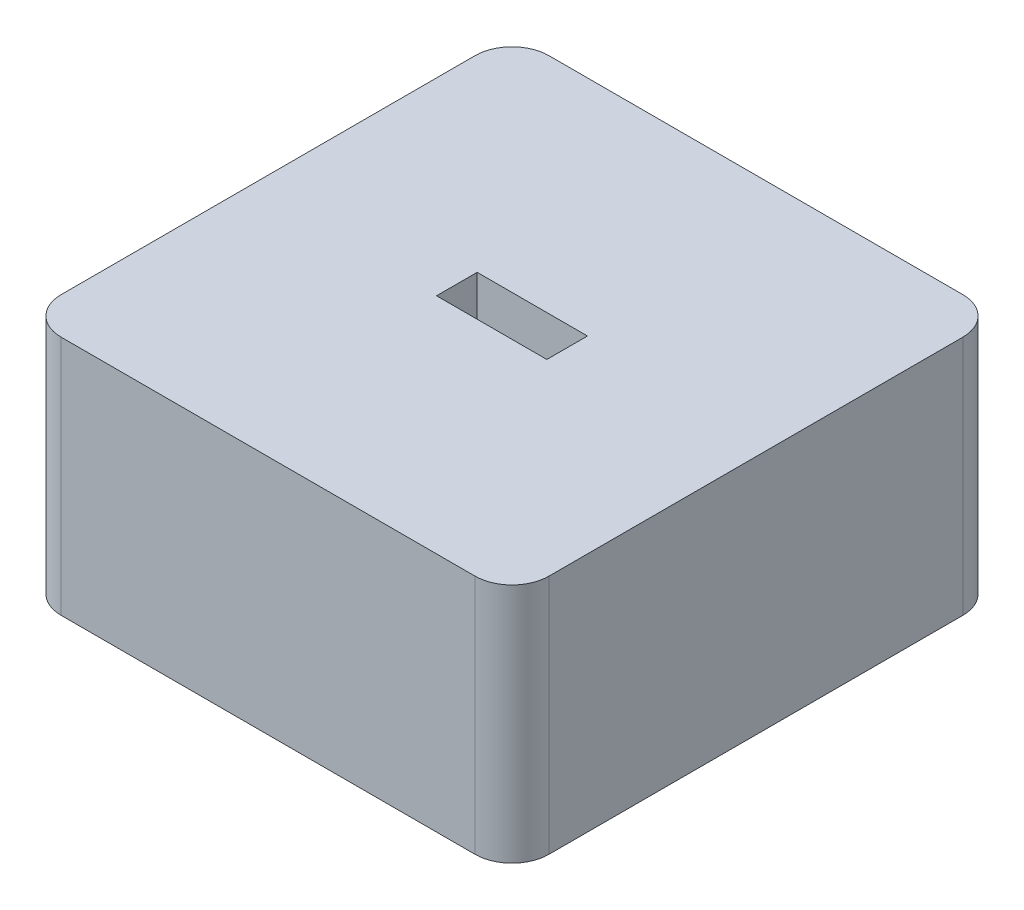
ISO-10303-21;
HEADER;
FILE_DESCRIPTION(('STEP AP214'),'2;1');
FILE_NAME('part.step','',(''),(''),'','','');
FILE_SCHEMA(('AUTOMOTIVE_DESIGN { 1 0 10303 214 1 1 1 1 }'));
ENDSEC;
DATA;
#1=APPLICATION_CONTEXT('core data for automotive mechanical design processes');
#2=APPLICATION_PROTOCOL_DEFINITION('international standard','automotive_design',2000,#1);
#3=PRODUCT_CONTEXT('',#1,'mechanical');
#4=PRODUCT('Part','Part','',(#3));
#5=PRODUCT_RELATED_PRODUCT_CATEGORY('part','',(#4));
#6=PRODUCT_DEFINITION_FORMATION('','',#4);
#7=PRODUCT_DEFINITION_CONTEXT('part definition',#1,'design');
#8=PRODUCT_DEFINITION('design','',#6,#7);
#9=PRODUCT_DEFINITION_SHAPE('','',#8);
#10=(LENGTH_UNIT() NAMED_UNIT(*) SI_UNIT(.MILLI.,.METRE.));
#11=(NAMED_UNIT(*) PLANE_ANGLE_UNIT() SI_UNIT($,.RADIAN.));
#12=(NAMED_UNIT(*) SI_UNIT($,.STERADIAN.) SOLID_ANGLE_UNIT());
#13=UNCERTAINTY_MEASURE_WITH_UNIT(LENGTH_MEASURE(1.E-05),#10,'distance_accuracy_value','');
#14=(GEOMETRIC_REPRESENTATION_CONTEXT(3) GLOBAL_UNCERTAINTY_ASSIGNED_CONTEXT((#13)) GLOBAL_UNIT_ASSIGNED_CONTEXT((#10,
#11,#12)) REPRESENTATION_CONTEXT('',''));
#15=CARTESIAN_POINT('',(0.,0.,0.));
#16=DIRECTION('',(0.,0.,1.));
#17=DIRECTION('',(1.,0.,0.));
#18=AXIS2_PLACEMENT_3D('',#15,#16,#17);
#19=CARTESIAN_POINT('',(0.,0.,0.));
#20=DIRECTION('',(0.,-1.,0.));
#21=DIRECTION('',(0.,0.,-1.));
#22=AXIS2_PLACEMENT_3D('',#19,#20,#21);
#23=PLANE('',#22);
#24=DIRECTION('',(0.,0.,-1.));
#25=VECTOR('',#24,1.);
#26=CARTESIAN_POINT('',(13.25,0.,-15.75));
#27=LINE('',#26,#25);
#28=CARTESIAN_POINT('',(13.25,0.,-15.75));
#29=VERTEX_POINT('',#28);
#30=CARTESIAN_POINT('',(13.25,0.,-26.25));
#31=VERTEX_POINT('',#30);
#32=EDGE_CURVE('E371',#29,#31,#27,.T.);
#33=ORIENTED_EDGE('',*,*,#32,.F.);
#34=DIRECTION('',(-1.,0.,0.));
#35=VECTOR('',#34,1.);
#36=CARTESIAN_POINT('',(13.25,0.,-15.75));
#37=LINE('',#36,#35);
#38=CARTESIAN_POINT('',(28.75,0.,-15.75));
#39=VERTEX_POINT('',#38);
#40=EDGE_CURVE('E377',#39,#29,#37,.T.);
#41=ORIENTED_EDGE('',*,*,#40,.F.);
#42=DIRECTION('',(0.,0.,1.));
#43=VECTOR('',#42,1.);
#44=CARTESIAN_POINT('',(28.75,0.,-15.75));
#45=LINE('',#44,#43);
#46=CARTESIAN_POINT('',(28.75,0.,-26.25));
#47=VERTEX_POINT('',#46);
#48=EDGE_CURVE('E396',#47,#39,#45,.T.);
#49=ORIENTED_EDGE('',*,*,#48,.F.);
#50=DIRECTION('',(1.,0.,0.));
#51=VECTOR('',#50,1.);
#52=CARTESIAN_POINT('',(13.25,0.,-26.25));
#53=LINE('',#52,#51);
#54=EDGE_CURVE('E392',#31,#47,#53,.T.);
#55=ORIENTED_EDGE('',*,*,#54,.F.);
#56=EDGE_LOOP('',(#33,#41,#49,#55));
#57=FACE_BOUND('',#56,.T.);
#58=DIRECTION('',(1.,0.,0.));
#59=VECTOR('',#58,1.);
#60=CARTESIAN_POINT('',(10.25,0.,-29.25));
#61=LINE('',#60,#59);
#62=CARTESIAN_POINT('',(10.25,0.,-29.25));
#63=VERTEX_POINT('',#62);
#64=CARTESIAN_POINT('',(31.75,0.,-29.25));
#65=VERTEX_POINT('',#64);
#66=EDGE_CURVE('E256',#63,#65,#61,.T.);
#67=ORIENTED_EDGE('',*,*,#66,.T.);
#68=DIRECTION('',(0.,0.,1.));
#69=VECTOR('',#68,1.);
#70=CARTESIAN_POINT('',(31.75,0.,-29.25));
#71=LINE('',#70,#69);
#72=CARTESIAN_POINT('',(31.75,0.,-12.75));
#73=VERTEX_POINT('',#72);
#74=EDGE_CURVE('E268',#65,#73,#71,.T.);
#75=ORIENTED_EDGE('',*,*,#74,.T.);
#76=DIRECTION('',(-1.,0.,0.));
#77=VECTOR('',#76,1.);
#78=CARTESIAN_POINT('',(31.75,0.,-12.75));
#79=LINE('',#78,#77);
#80=CARTESIAN_POINT('',(10.25,0.,-12.75));
#81=VERTEX_POINT('',#80);
#82=EDGE_CURVE('E232',#73,#81,#79,.T.);
#83=ORIENTED_EDGE('',*,*,#82,.T.);
#84=DIRECTION('',(0.,0.,-1.));
#85=VECTOR('',#84,1.);
#86=CARTESIAN_POINT('',(10.25,0.,-12.75));
#87=LINE('',#86,#85);
#88=EDGE_CURVE('E261',#81,#63,#87,.T.);
#89=ORIENTED_EDGE('',*,*,#88,.T.);
#90=EDGE_LOOP('',(#67,#75,#83,#89));
#91=FACE_BOUND('',#90,.T.);
#92=ADVANCED_FACE('F39',(#57,#91),#23,.T.);
#93=CARTESIAN_POINT('',(0.,17.23,0.));
#94=DIRECTION('',(0.,-1.,0.));
#95=DIRECTION('',(0.,0.,-1.));
#96=AXIS2_PLACEMENT_3D('',#93,#94,#95);
#97=PLANE('',#96);
#98=DIRECTION('',(1.,0.,0.));
#99=VECTOR('',#98,1.);
#100=CARTESIAN_POINT('',(16.25,17.23,-22.75));
#101=LINE('',#100,#99);
#102=CARTESIAN_POINT('',(16.25,17.23,-22.75));
#103=VERTEX_POINT('',#102);
#104=CARTESIAN_POINT('',(25.75,17.23,-22.75));
#105=VERTEX_POINT('',#104);
#106=EDGE_CURVE('E416',#103,#105,#101,.T.);
#107=ORIENTED_EDGE('',*,*,#106,.F.);
#108=DIRECTION('',(0.,0.,1.));
#109=VECTOR('',#108,1.);
#110=CARTESIAN_POINT('',(16.25,17.23,-22.75));
#111=LINE('',#110,#109);
#112=CARTESIAN_POINT('',(16.25,17.23,-19.25));
#113=VERTEX_POINT('',#112);
#114=EDGE_CURVE('E428',#103,#113,#111,.T.);
#115=ORIENTED_EDGE('',*,*,#114,.T.);
#116=DIRECTION('',(1.,0.,0.));
#117=VECTOR('',#116,1.);
#118=CARTESIAN_POINT('',(16.25,17.23,-19.25));
#119=LINE('',#118,#117);
#120=CARTESIAN_POINT('',(25.75,17.23,-19.25));
#121=VERTEX_POINT('',#120);
#122=EDGE_CURVE('E424',#113,#121,#119,.T.);
#123=ORIENTED_EDGE('',*,*,#122,.T.);
#124=DIRECTION('',(0.,0.,1.));
#125=VECTOR('',#124,1.);
#126=CARTESIAN_POINT('',(25.75,17.23,-22.75));
#127=LINE('',#126,#125);
#128=EDGE_CURVE('E420',#105,#121,#127,.T.);
#129=ORIENTED_EDGE('',*,*,#128,.F.);
#130=EDGE_LOOP('',(#107,#115,#123,#129));
#131=FACE_BOUND('',#130,.T.);
#132=CARTESIAN_POINT('',(17.975,17.23,-21.));
#133=DIRECTION('',(0.,1.,0.));
#134=DIRECTION('',(0.,0.,1.));
#135=AXIS2_PLACEMENT_3D('',#132,#133,#134);
#136=CIRCLE('',#135,1.275);
#137=CARTESIAN_POINT('',(17.975,17.23,-22.275));
#138=VERTEX_POINT('',#137);
#139=CARTESIAN_POINT('',(17.975,17.23,-19.725));
#140=VERTEX_POINT('',#139);
#141=EDGE_CURVE('E339',#138,#140,#136,.T.);
#142=ORIENTED_EDGE('',*,*,#141,.F.);
#143=DIRECTION('',(-1.,0.,0.));
#144=VECTOR('',#143,1.);
#145=CARTESIAN_POINT('',(17.975,17.23,-22.275));
#146=LINE('',#145,#144);
#147=CARTESIAN_POINT('',(24.025,17.23,-22.275));
#148=VERTEX_POINT('',#147);
#149=EDGE_CURVE('E350',#148,#138,#146,.T.);
#150=ORIENTED_EDGE('',*,*,#149,.F.);
#151=CARTESIAN_POINT('',(24.025,17.23,-21.));
#152=DIRECTION('',(0.,1.,0.));
#153=DIRECTION('',(0.,0.,1.));
#154=AXIS2_PLACEMENT_3D('',#151,#152,#153);
#155=CIRCLE('',#154,1.275);
#156=CARTESIAN_POINT('',(24.025,17.23,-19.725));
#157=VERTEX_POINT('',#156);
#158=EDGE_CURVE('E347',#157,#148,#155,.T.);
#159=ORIENTED_EDGE('',*,*,#158,.F.);
#160=DIRECTION('',(1.,0.,0.));
#161=VECTOR('',#160,1.);
#162=CARTESIAN_POINT('',(17.975,17.23,-19.725));
#163=LINE('',#162,#161);
#164=EDGE_CURVE('E343',#140,#157,#163,.T.);
#165=ORIENTED_EDGE('',*,*,#164,.F.);
#166=EDGE_LOOP('',(#142,#150,#159,#165));
#167=FACE_BOUND('',#166,.T.);
#168=ADVANCED_FACE('F574',(#131,#167),#97,.F.);
#169=CARTESIAN_POINT('',(0.,15.23,0.));
#170=DIRECTION('',(0.,-1.,0.));
#171=DIRECTION('',(0.,0.,-1.));
#172=AXIS2_PLACEMENT_3D('',#169,#170,#171);
#173=PLANE('',#172);
#174=DIRECTION('',(0.,0.,-1.));
#175=VECTOR('',#174,1.);
#176=CARTESIAN_POINT('',(13.25,15.23,-15.75));
#177=LINE('',#176,#175);
#178=CARTESIAN_POINT('',(13.25,15.23,-15.75));
#179=VERTEX_POINT('',#178);
#180=CARTESIAN_POINT('',(13.25,15.23,-26.25));
#181=VERTEX_POINT('',#180);
#182=EDGE_CURVE('E372',#179,#181,#177,.T.);
#183=ORIENTED_EDGE('',*,*,#182,.T.);
#184=DIRECTION('',(1.,0.,0.));
#185=VECTOR('',#184,1.);
#186=CARTESIAN_POINT('',(13.25,15.23,-26.25));
#187=LINE('',#186,#185);
#188=CARTESIAN_POINT('',(28.75,15.23,-26.25));
#189=VERTEX_POINT('',#188);
#190=EDGE_CURVE('E376',#181,#189,#187,.T.);
#191=ORIENTED_EDGE('',*,*,#190,.T.);
#192=DIRECTION('',(0.,0.,1.));
#193=VECTOR('',#192,1.);
#194=CARTESIAN_POINT('',(28.75,15.23,-15.75));
#195=LINE('',#194,#193);
#196=CARTESIAN_POINT('',(28.75,15.23,-15.75));
#197=VERTEX_POINT('',#196);
#198=EDGE_CURVE('E381',#189,#197,#195,.T.);
#199=ORIENTED_EDGE('',*,*,#198,.T.);
#200=DIRECTION('',(-1.,0.,0.));
#201=VECTOR('',#200,1.);
#202=CARTESIAN_POINT('',(13.25,15.23,-15.75));
#203=LINE('',#202,#201);
#204=EDGE_CURVE('E385',#197,#179,#203,.T.);
#205=ORIENTED_EDGE('',*,*,#204,.T.);
#206=EDGE_LOOP('',(#183,#191,#199,#205));
#207=FACE_BOUND('',#206,.T.);
#208=DIRECTION('',(-1.,0.,0.));
#209=VECTOR('',#208,1.);
#210=CARTESIAN_POINT('',(17.975,15.23,-22.275));
#211=LINE('',#210,#209);
#212=CARTESIAN_POINT('',(24.025,15.23,-22.275));
#213=VERTEX_POINT('',#212);
#214=CARTESIAN_POINT('',(17.975,15.23,-22.275));
#215=VERTEX_POINT('',#214);
#216=EDGE_CURVE('E331',#213,#215,#211,.T.);
#217=ORIENTED_EDGE('',*,*,#216,.T.);
#218=CARTESIAN_POINT('',(17.975,15.23,-21.));
#219=DIRECTION('',(0.,-1.,0.));
#220=DIRECTION('',(0.,0.,-1.));
#221=AXIS2_PLACEMENT_3D('',#218,#219,#220);
#222=CIRCLE('',#221,1.275);
#223=CARTESIAN_POINT('',(17.975,15.23,-19.725));
#224=VERTEX_POINT('',#223);
#225=EDGE_CURVE('E335',#215,#224,#222,.F.);
#226=ORIENTED_EDGE('',*,*,#225,.T.);
#227=DIRECTION('',(1.,0.,0.));
#228=VECTOR('',#227,1.);
#229=CARTESIAN_POINT('',(17.975,15.23,-19.725));
#230=LINE('',#229,#228);
#231=CARTESIAN_POINT('',(24.025,15.23,-19.725));
#232=VERTEX_POINT('',#231);
#233=EDGE_CURVE('E358',#224,#232,#230,.T.);
#234=ORIENTED_EDGE('',*,*,#233,.T.);
#235=CARTESIAN_POINT('',(24.025,15.23,-21.));
#236=DIRECTION('',(0.,-1.,0.));
#237=DIRECTION('',(0.,0.,-1.));
#238=AXIS2_PLACEMENT_3D('',#235,#236,#237);
#239=CIRCLE('',#238,1.275);
#240=EDGE_CURVE('E318',#232,#213,#239,.F.);
#241=ORIENTED_EDGE('',*,*,#240,.T.);
#242=EDGE_LOOP('',(#217,#226,#234,#241));
#243=FACE_BOUND('',#242,.T.);
#244=ADVANCED_FACE('F580',(#207,#243),#173,.T.);
#245=CARTESIAN_POINT('',(0.,20.75,0.));
#246=DIRECTION('',(0.,-1.,0.));
#247=DIRECTION('',(0.,0.,-1.));
#248=AXIS2_PLACEMENT_3D('',#245,#246,#247);
#249=PLANE('',#248);
#250=DIRECTION('',(0.,0.,-1.));
#251=VECTOR('',#250,1.);
#252=CARTESIAN_POINT('',(42.,20.75,0.));
#253=LINE('',#252,#251);
#254=CARTESIAN_POINT('',(42.,20.75,-3.175));
#255=VERTEX_POINT('',#254);
#256=CARTESIAN_POINT('',(42.,20.75,-38.825));
#257=VERTEX_POINT('',#256);
#258=EDGE_CURVE('E468',#255,#257,#253,.T.);
#259=ORIENTED_EDGE('',*,*,#258,.T.);
#260=CARTESIAN_POINT('',(38.825,20.75,-38.825));
#261=DIRECTION('',(0.,-1.,0.));
#262=DIRECTION('',(0.,0.,-1.));
#263=AXIS2_PLACEMENT_3D('',#260,#261,#262);
#264=CIRCLE('',#263,3.175);
#265=CARTESIAN_POINT('',(38.825,20.75,-42.));
#266=VERTEX_POINT('',#265);
#267=EDGE_CURVE('E523',#257,#266,#264,.F.);
#268=ORIENTED_EDGE('',*,*,#267,.T.);
#269=DIRECTION('',(-1.,0.,0.));
#270=VECTOR('',#269,1.);
#271=CARTESIAN_POINT('',(0.,20.75,-42.));
#272=LINE('',#271,#270);
#273=CARTESIAN_POINT('',(3.175,20.75,-42.));
#274=VERTEX_POINT('',#273);
#275=EDGE_CURVE('E472',#266,#274,#272,.T.);
#276=ORIENTED_EDGE('',*,*,#275,.T.);
#277=CARTESIAN_POINT('',(3.175,20.75,-38.825));
#278=DIRECTION('',(0.,-1.,0.));
#279=DIRECTION('',(0.,0.,-1.));
#280=AXIS2_PLACEMENT_3D('',#277,#278,#279);
#281=CIRCLE('',#280,3.175);
#282=CARTESIAN_POINT('',(0.,20.75,-38.825));
#283=VERTEX_POINT('',#282);
#284=EDGE_CURVE('E515',#274,#283,#281,.F.);
#285=ORIENTED_EDGE('',*,*,#284,.T.);
#286=DIRECTION('',(0.,0.,1.));
#287=VECTOR('',#286,1.);
#288=CARTESIAN_POINT('',(0.,20.75,0.));
#289=LINE('',#288,#287);
#290=CARTESIAN_POINT('',(0.,20.75,-3.175));
#291=VERTEX_POINT('',#290);
#292=EDGE_CURVE('E461',#283,#291,#289,.T.);
#293=ORIENTED_EDGE('',*,*,#292,.T.);
#294=CARTESIAN_POINT('',(3.175,20.75,-3.175));
#295=DIRECTION('',(0.,-1.,0.));
#296=DIRECTION('',(0.,0.,-1.));
#297=AXIS2_PLACEMENT_3D('',#294,#295,#296);
#298=CIRCLE('',#297,3.175);
#299=CARTESIAN_POINT('',(3.175,20.75,0.));
#300=VERTEX_POINT('',#299);
#301=EDGE_CURVE('E62',#291,#300,#298,.F.);
#302=ORIENTED_EDGE('',*,*,#301,.T.);
#303=DIRECTION('',(1.,0.,0.));
#304=VECTOR('',#303,1.);
#305=CARTESIAN_POINT('',(0.,20.75,0.));
#306=LINE('',#305,#304);
#307=CARTESIAN_POINT('',(38.825,20.75,0.));
#308=VERTEX_POINT('',#307);
#309=EDGE_CURVE('E464',#300,#308,#306,.T.);
#310=ORIENTED_EDGE('',*,*,#309,.T.);
#311=CARTESIAN_POINT('',(38.825,20.75,-3.175));
#312=DIRECTION('',(0.,-1.,0.));
#313=DIRECTION('',(0.,0.,-1.));
#314=AXIS2_PLACEMENT_3D('',#311,#312,#313);
#315=CIRCLE('',#314,3.175);
#316=EDGE_CURVE('E520',#308,#255,#315,.F.);
#317=ORIENTED_EDGE('',*,*,#316,.T.);
#318=EDGE_LOOP('',(#259,#268,#276,#285,#293,#302,#310,#317));
#319=FACE_BOUND('',#318,.T.);
#320=DIRECTION('',(1.,0.,0.));
#321=VECTOR('',#320,1.);
#322=CARTESIAN_POINT('',(16.25,20.75,-22.75));
#323=LINE('',#322,#321);
#324=CARTESIAN_POINT('',(16.25,20.75,-22.75));
#325=VERTEX_POINT('',#324);
#326=CARTESIAN_POINT('',(25.75,20.75,-22.75));
#327=VERTEX_POINT('',#326);
#328=EDGE_CURVE('E406',#325,#327,#323,.T.);
#329=ORIENTED_EDGE('',*,*,#328,.T.);
#330=DIRECTION('',(0.,0.,1.));
#331=VECTOR('',#330,1.);
#332=CARTESIAN_POINT('',(25.75,20.75,-22.75));
#333=LINE('',#332,#331);
#334=CARTESIAN_POINT('',(25.75,20.75,-19.25));
#335=VERTEX_POINT('',#334);
#336=EDGE_CURVE('E436',#327,#335,#333,.T.);
#337=ORIENTED_EDGE('',*,*,#336,.T.);
#338=DIRECTION('',(1.,0.,0.));
#339=VECTOR('',#338,1.);
#340=CARTESIAN_POINT('',(16.25,20.75,-19.25));
#341=LINE('',#340,#339);
#342=CARTESIAN_POINT('',(16.25,20.75,-19.25));
#343=VERTEX_POINT('',#342);
#344=EDGE_CURVE('E440',#343,#335,#341,.T.);
#345=ORIENTED_EDGE('',*,*,#344,.F.);
#346=DIRECTION('',(0.,0.,1.));
#347=VECTOR('',#346,1.);
#348=CARTESIAN_POINT('',(16.25,20.75,-22.75));
#349=LINE('',#348,#347);
#350=EDGE_CURVE('E421',#325,#343,#349,.T.);
#351=ORIENTED_EDGE('',*,*,#350,.F.);
#352=EDGE_LOOP('',(#329,#337,#345,#351));
#353=FACE_BOUND('',#352,.T.);
#354=ADVANCED_FACE('F551',(#319,#353),#249,.F.);
#355=CARTESIAN_POINT('',(0.,20.75,0.));
#356=DIRECTION('',(1.,0.,0.));
#357=DIRECTION('',(0.,0.,-1.));
#358=AXIS2_PLACEMENT_3D('',#355,#356,#357);
#359=PLANE('',#358);
#360=DIRECTION('',(0.,0.,1.));
#361=VECTOR('',#360,1.);
#362=CARTESIAN_POINT('',(0.,0.,0.));
#363=LINE('',#362,#361);
#364=CARTESIAN_POINT('',(0.,0.,-38.825));
#365=VERTEX_POINT('',#364);
#366=CARTESIAN_POINT('',(0.,0.,-3.175));
#367=VERTEX_POINT('',#366);
#368=EDGE_CURVE('E460',#365,#367,#363,.T.);
#369=ORIENTED_EDGE('',*,*,#368,.T.);
#370=DIRECTION('',(0.,-1.,0.));
#371=VECTOR('',#370,1.);
#372=CARTESIAN_POINT('',(0.,20.75,-3.175));
#373=LINE('',#372,#371);
#374=EDGE_CURVE('E11',#367,#291,#373,.F.);
#375=ORIENTED_EDGE('',*,*,#374,.T.);
#376=ORIENTED_EDGE('',*,*,#292,.F.);
#377=DIRECTION('',(0.,-1.,0.));
#378=VECTOR('',#377,1.);
#379=CARTESIAN_POINT('',(0.,20.75,-38.825));
#380=LINE('',#379,#378);
#381=EDGE_CURVE('E48',#283,#365,#380,.T.);
#382=ORIENTED_EDGE('',*,*,#381,.T.);
#383=EDGE_LOOP('',(#369,#375,#376,#382));
#384=FACE_BOUND('',#383,.T.);
#385=ADVANCED_FACE('F538',(#384),#359,.F.);
#386=CARTESIAN_POINT('',(0.,20.75,0.));
#387=DIRECTION('',(0.,0.,-1.));
#388=DIRECTION('',(-1.,0.,0.));
#389=AXIS2_PLACEMENT_3D('',#386,#387,#388);
#390=PLANE('',#389);
#391=DIRECTION('',(1.,0.,0.));
#392=VECTOR('',#391,1.);
#393=CARTESIAN_POINT('',(0.,0.,0.));
#394=LINE('',#393,#392);
#395=CARTESIAN_POINT('',(3.175,0.,0.));
#396=VERTEX_POINT('',#395);
#397=CARTESIAN_POINT('',(38.825,0.,0.));
#398=VERTEX_POINT('',#397);
#399=EDGE_CURVE('E480',#396,#398,#394,.T.);
#400=ORIENTED_EDGE('',*,*,#399,.T.);
#401=DIRECTION('',(0.,-1.,0.));
#402=VECTOR('',#401,1.);
#403=CARTESIAN_POINT('',(38.825,20.75,0.));
#404=LINE('',#403,#402);
#405=EDGE_CURVE('E55',#398,#308,#404,.F.);
#406=ORIENTED_EDGE('',*,*,#405,.T.);
#407=ORIENTED_EDGE('',*,*,#309,.F.);
#408=DIRECTION('',(0.,-1.,0.));
#409=VECTOR('',#408,1.);
#410=CARTESIAN_POINT('',(3.175,20.75,0.));
#411=LINE('',#410,#409);
#412=EDGE_CURVE('E526',#300,#396,#411,.T.);
#413=ORIENTED_EDGE('',*,*,#412,.T.);
#414=EDGE_LOOP('',(#400,#406,#407,#413));
#415=FACE_BOUND('',#414,.T.);
#416=ADVANCED_FACE('F549',(#415),#390,.F.);
#417=CARTESIAN_POINT('',(42.,20.75,0.));
#418=DIRECTION('',(-1.,0.,0.));
#419=DIRECTION('',(0.,0.,1.));
#420=AXIS2_PLACEMENT_3D('',#417,#418,#419);
#421=PLANE('',#420);
#422=DIRECTION('',(0.,0.,-1.));
#423=VECTOR('',#422,1.);
#424=CARTESIAN_POINT('',(42.,0.,0.));
#425=LINE('',#424,#423);
#426=CARTESIAN_POINT('',(42.,0.,-3.175));
#427=VERTEX_POINT('',#426);
#428=CARTESIAN_POINT('',(42.,0.,-38.825));
#429=VERTEX_POINT('',#428);
#430=EDGE_CURVE('E483',#427,#429,#425,.T.);
#431=ORIENTED_EDGE('',*,*,#430,.T.);
#432=DIRECTION('',(0.,-1.,0.));
#433=VECTOR('',#432,1.);
#434=CARTESIAN_POINT('',(42.,20.75,-38.825));
#435=LINE('',#434,#433);
#436=EDGE_CURVE('E512',#429,#257,#435,.F.);
#437=ORIENTED_EDGE('',*,*,#436,.T.);
#438=ORIENTED_EDGE('',*,*,#258,.F.);
#439=DIRECTION('',(0.,-1.,0.));
#440=VECTOR('',#439,1.);
#441=CARTESIAN_POINT('',(42.,20.75,-3.175));
#442=LINE('',#441,#440);
#443=EDGE_CURVE('E508',#255,#427,#442,.T.);
#444=ORIENTED_EDGE('',*,*,#443,.T.);
#445=EDGE_LOOP('',(#431,#437,#438,#444));
#446=FACE_BOUND('',#445,.T.);
#447=ADVANCED_FACE('F559',(#446),#421,.F.);
#448=CARTESIAN_POINT('',(0.,20.75,-42.));
#449=DIRECTION('',(0.,0.,1.));
#450=DIRECTION('',(1.,0.,0.));
#451=AXIS2_PLACEMENT_3D('',#448,#449,#450);
#452=PLANE('',#451);
#453=ORIENTED_EDGE('',*,*,#275,.F.);
#454=DIRECTION('',(0.,-1.,0.));
#455=VECTOR('',#454,1.);
#456=CARTESIAN_POINT('',(38.825,20.75,-42.));
#457=LINE('',#456,#455);
#458=CARTESIAN_POINT('',(38.825,0.,-42.));
#459=VERTEX_POINT('',#458);
#460=EDGE_CURVE('E492',#266,#459,#457,.T.);
#461=ORIENTED_EDGE('',*,*,#460,.T.);
#462=DIRECTION('',(-1.,0.,0.));
#463=VECTOR('',#462,1.);
#464=CARTESIAN_POINT('',(0.,0.,-42.));
#465=LINE('',#464,#463);
#466=CARTESIAN_POINT('',(3.175,0.,-42.));
#467=VERTEX_POINT('',#466);
#468=EDGE_CURVE('E465',#459,#467,#465,.T.);
#469=ORIENTED_EDGE('',*,*,#468,.T.);
#470=DIRECTION('',(0.,-1.,0.));
#471=VECTOR('',#470,1.);
#472=CARTESIAN_POINT('',(3.175,20.75,-42.));
#473=LINE('',#472,#471);
#474=EDGE_CURVE('E476',#467,#274,#473,.F.);
#475=ORIENTED_EDGE('',*,*,#474,.T.);
#476=EDGE_LOOP('',(#453,#461,#469,#475));
#477=FACE_BOUND('',#476,.T.);
#478=ADVANCED_FACE('F567',(#477),#452,.F.);
#479=DIRECTION('',(0.,0.,-1.));
#480=VECTOR('',#479,1.);
#481=CARTESIAN_POINT('',(4.,0.,-4.));
#482=LINE('',#481,#480);
#483=CARTESIAN_POINT('',(4.,0.,-4.));
#484=VERTEX_POINT('',#483);
#485=CARTESIAN_POINT('',(4.,0.,-38.));
#486=VERTEX_POINT('',#485);
#487=EDGE_CURVE('E278',#484,#486,#482,.T.);
#488=ORIENTED_EDGE('',*,*,#487,.F.);
#489=DIRECTION('',(-1.,0.,0.));
#490=VECTOR('',#489,1.);
#491=CARTESIAN_POINT('',(4.,0.,-4.));
#492=LINE('',#491,#490);
#493=CARTESIAN_POINT('',(38.,0.,-4.));
#494=VERTEX_POINT('',#493);
#495=EDGE_CURVE('E289',#494,#484,#492,.T.);
#496=ORIENTED_EDGE('',*,*,#495,.F.);
#497=DIRECTION('',(0.,0.,1.));
#498=VECTOR('',#497,1.);
#499=CARTESIAN_POINT('',(38.,0.,-4.));
#500=LINE('',#499,#498);
#501=CARTESIAN_POINT('',(38.,0.,-38.));
#502=VERTEX_POINT('',#501);
#503=EDGE_CURVE('E308',#502,#494,#500,.T.);
#504=ORIENTED_EDGE('',*,*,#503,.F.);
#505=DIRECTION('',(1.,0.,0.));
#506=VECTOR('',#505,1.);
#507=CARTESIAN_POINT('',(4.,0.,-38.));
#508=LINE('',#507,#506);
#509=EDGE_CURVE('E304',#486,#502,#508,.T.);
#510=ORIENTED_EDGE('',*,*,#509,.F.);
#511=EDGE_LOOP('',(#488,#496,#504,#510));
#512=FACE_BOUND('',#511,.T.);
#513=ORIENTED_EDGE('',*,*,#468,.F.);
#514=CARTESIAN_POINT('',(38.825,0.,-38.825));
#515=DIRECTION('',(0.,-1.,0.));
#516=DIRECTION('',(0.,0.,-1.));
#517=AXIS2_PLACEMENT_3D('',#514,#515,#516);
#518=CIRCLE('',#517,3.175);
#519=EDGE_CURVE('E505',#459,#429,#518,.T.);
#520=ORIENTED_EDGE('',*,*,#519,.T.);
#521=ORIENTED_EDGE('',*,*,#430,.F.);
#522=CARTESIAN_POINT('',(38.825,0.,-3.175));
#523=DIRECTION('',(0.,-1.,0.));
#524=DIRECTION('',(0.,0.,-1.));
#525=AXIS2_PLACEMENT_3D('',#522,#523,#524);
#526=CIRCLE('',#525,3.175);
#527=EDGE_CURVE('E502',#427,#398,#526,.T.);
#528=ORIENTED_EDGE('',*,*,#527,.T.);
#529=ORIENTED_EDGE('',*,*,#399,.F.);
#530=CARTESIAN_POINT('',(3.175,0.,-3.175));
#531=DIRECTION('',(0.,-1.,0.));
#532=DIRECTION('',(0.,0.,-1.));
#533=AXIS2_PLACEMENT_3D('',#530,#531,#532);
#534=CIRCLE('',#533,3.175);
#535=EDGE_CURVE('E499',#396,#367,#534,.T.);
#536=ORIENTED_EDGE('',*,*,#535,.T.);
#537=ORIENTED_EDGE('',*,*,#368,.F.);
#538=CARTESIAN_POINT('',(3.175,0.,-38.825));
#539=DIRECTION('',(0.,-1.,0.));
#540=DIRECTION('',(0.,0.,-1.));
#541=AXIS2_PLACEMENT_3D('',#538,#539,#540);
#542=CIRCLE('',#541,3.175);
#543=EDGE_CURVE('E496',#365,#467,#542,.T.);
#544=ORIENTED_EDGE('',*,*,#543,.T.);
#545=EDGE_LOOP('',(#513,#520,#521,#528,#529,#536,#537,#544));
#546=FACE_BOUND('',#545,.T.);
#547=ADVANCED_FACE('F544',(#512,#546),#23,.T.);
#548=CARTESIAN_POINT('',(16.25,17.23,-22.75));
#549=DIRECTION('',(0.,0.,1.));
#550=DIRECTION('',(1.,0.,0.));
#551=AXIS2_PLACEMENT_3D('',#548,#549,#550);
#552=PLANE('',#551);
#553=ORIENTED_EDGE('',*,*,#328,.F.);
#554=DIRECTION('',(0.,1.,0.));
#555=VECTOR('',#554,1.);
#556=CARTESIAN_POINT('',(16.25,17.23,-22.75));
#557=LINE('',#556,#555);
#558=EDGE_CURVE('E432',#103,#325,#557,.T.);
#559=ORIENTED_EDGE('',*,*,#558,.F.);
#560=ORIENTED_EDGE('',*,*,#106,.T.);
#561=DIRECTION('',(0.,1.,0.));
#562=VECTOR('',#561,1.);
#563=CARTESIAN_POINT('',(25.75,17.23,-22.75));
#564=LINE('',#563,#562);
#565=EDGE_CURVE('E456',#105,#327,#564,.T.);
#566=ORIENTED_EDGE('',*,*,#565,.T.);
#567=EDGE_LOOP('',(#553,#559,#560,#566));
#568=FACE_BOUND('',#567,.T.);
#569=ADVANCED_FACE('F588',(#568),#552,.T.);
#570=CARTESIAN_POINT('',(25.75,17.23,-22.75));
#571=DIRECTION('',(-1.,0.,0.));
#572=DIRECTION('',(0.,0.,1.));
#573=AXIS2_PLACEMENT_3D('',#570,#571,#572);
#574=PLANE('',#573);
#575=ORIENTED_EDGE('',*,*,#336,.F.);
#576=ORIENTED_EDGE('',*,*,#565,.F.);
#577=ORIENTED_EDGE('',*,*,#128,.T.);
#578=DIRECTION('',(0.,1.,0.));
#579=VECTOR('',#578,1.);
#580=CARTESIAN_POINT('',(25.75,17.23,-19.25));
#581=LINE('',#580,#579);
#582=EDGE_CURVE('E453',#121,#335,#581,.T.);
#583=ORIENTED_EDGE('',*,*,#582,.T.);
#584=EDGE_LOOP('',(#575,#576,#577,#583));
#585=FACE_BOUND('',#584,.T.);
#586=ADVANCED_FACE('F594',(#585),#574,.T.);
#587=CARTESIAN_POINT('',(16.25,17.23,-19.25));
#588=DIRECTION('',(0.,0.,1.));
#589=DIRECTION('',(1.,0.,0.));
#590=AXIS2_PLACEMENT_3D('',#587,#588,#589);
#591=PLANE('',#590);
#592=ORIENTED_EDGE('',*,*,#344,.T.);
#593=ORIENTED_EDGE('',*,*,#582,.F.);
#594=ORIENTED_EDGE('',*,*,#122,.F.);
#595=DIRECTION('',(0.,1.,0.));
#596=VECTOR('',#595,1.);
#597=CARTESIAN_POINT('',(16.25,17.23,-19.25));
#598=LINE('',#597,#596);
#599=EDGE_CURVE('E450',#113,#343,#598,.T.);
#600=ORIENTED_EDGE('',*,*,#599,.T.);
#601=EDGE_LOOP('',(#592,#593,#594,#600));
#602=FACE_BOUND('',#601,.T.);
#603=ADVANCED_FACE('F663',(#602),#591,.F.);
#604=CARTESIAN_POINT('',(16.25,17.23,-22.75));
#605=DIRECTION('',(-1.,0.,0.));
#606=DIRECTION('',(0.,0.,1.));
#607=AXIS2_PLACEMENT_3D('',#604,#605,#606);
#608=PLANE('',#607);
#609=ORIENTED_EDGE('',*,*,#350,.T.);
#610=ORIENTED_EDGE('',*,*,#599,.F.);
#611=ORIENTED_EDGE('',*,*,#114,.F.);
#612=ORIENTED_EDGE('',*,*,#558,.T.);
#613=EDGE_LOOP('',(#609,#610,#611,#612));
#614=FACE_BOUND('',#613,.T.);
#615=ADVANCED_FACE('F658',(#614),#608,.F.);
#616=CARTESIAN_POINT('',(13.25,15.23,-15.75));
#617=DIRECTION('',(-1.,0.,0.));
#618=DIRECTION('',(0.,0.,1.));
#619=AXIS2_PLACEMENT_3D('',#616,#617,#618);
#620=PLANE('',#619);
#621=ORIENTED_EDGE('',*,*,#32,.T.);
#622=DIRECTION('',(0.,-1.,0.));
#623=VECTOR('',#622,1.);
#624=CARTESIAN_POINT('',(13.25,15.23,-26.25));
#625=LINE('',#624,#623);
#626=EDGE_CURVE('E389',#181,#31,#625,.T.);
#627=ORIENTED_EDGE('',*,*,#626,.F.);
#628=ORIENTED_EDGE('',*,*,#182,.F.);
#629=DIRECTION('',(0.,-1.,0.));
#630=VECTOR('',#629,1.);
#631=CARTESIAN_POINT('',(13.25,15.23,-15.75));
#632=LINE('',#631,#630);
#633=EDGE_CURVE('E403',#179,#29,#632,.T.);
#634=ORIENTED_EDGE('',*,*,#633,.T.);
#635=EDGE_LOOP('',(#621,#627,#628,#634));
#636=FACE_BOUND('',#635,.T.);
#637=ADVANCED_FACE('F649',(#636),#620,.F.);
#638=CARTESIAN_POINT('',(13.25,15.23,-15.75));
#639=DIRECTION('',(0.,0.,1.));
#640=DIRECTION('',(1.,0.,0.));
#641=AXIS2_PLACEMENT_3D('',#638,#639,#640);
#642=PLANE('',#641);
#643=ORIENTED_EDGE('',*,*,#40,.T.);
#644=ORIENTED_EDGE('',*,*,#633,.F.);
#645=ORIENTED_EDGE('',*,*,#204,.F.);
#646=DIRECTION('',(0.,-1.,0.));
#647=VECTOR('',#646,1.);
#648=CARTESIAN_POINT('',(28.75,15.23,-15.75));
#649=LINE('',#648,#647);
#650=EDGE_CURVE('E407',#197,#39,#649,.T.);
#651=ORIENTED_EDGE('',*,*,#650,.T.);
#652=EDGE_LOOP('',(#643,#644,#645,#651));
#653=FACE_BOUND('',#652,.T.);
#654=ADVANCED_FACE('F645',(#653),#642,.F.);
#655=CARTESIAN_POINT('',(28.75,15.23,-15.75));
#656=DIRECTION('',(1.,0.,0.));
#657=DIRECTION('',(0.,0.,-1.));
#658=AXIS2_PLACEMENT_3D('',#655,#656,#657);
#659=PLANE('',#658);
#660=ORIENTED_EDGE('',*,*,#48,.T.);
#661=ORIENTED_EDGE('',*,*,#650,.F.);
#662=ORIENTED_EDGE('',*,*,#198,.F.);
#663=DIRECTION('',(0.,-1.,0.));
#664=VECTOR('',#663,1.);
#665=CARTESIAN_POINT('',(28.75,15.23,-26.25));
#666=LINE('',#665,#664);
#667=EDGE_CURVE('E410',#189,#47,#666,.T.);
#668=ORIENTED_EDGE('',*,*,#667,.T.);
#669=EDGE_LOOP('',(#660,#661,#662,#668));
#670=FACE_BOUND('',#669,.T.);
#671=ADVANCED_FACE('F648',(#670),#659,.F.);
#672=CARTESIAN_POINT('',(13.25,15.23,-26.25));
#673=DIRECTION('',(0.,0.,-1.));
#674=DIRECTION('',(-1.,0.,0.));
#675=AXIS2_PLACEMENT_3D('',#672,#673,#674);
#676=PLANE('',#675);
#677=ORIENTED_EDGE('',*,*,#54,.T.);
#678=ORIENTED_EDGE('',*,*,#667,.F.);
#679=ORIENTED_EDGE('',*,*,#190,.F.);
#680=ORIENTED_EDGE('',*,*,#626,.T.);
#681=EDGE_LOOP('',(#677,#678,#679,#680));
#682=FACE_BOUND('',#681,.T.);
#683=ADVANCED_FACE('F640',(#682),#676,.F.);
#684=CARTESIAN_POINT('',(17.975,-0.001000000000001,-21.));
#685=DIRECTION('',(0.,1.,0.));
#686=DIRECTION('',(0.,0.,1.));
#687=AXIS2_PLACEMENT_3D('',#684,#685,#686);
#688=CYLINDRICAL_SURFACE('',#687,1.275);
#689=DIRECTION('',(0.,1.,0.));
#690=VECTOR('',#689,1.);
#691=CARTESIAN_POINT('',(17.975,-0.001000000000001,-22.275));
#692=LINE('',#691,#690);
#693=EDGE_CURVE('E355',#215,#138,#692,.T.);
#694=ORIENTED_EDGE('',*,*,#693,.T.);
#695=ORIENTED_EDGE('',*,*,#141,.T.);
#696=DIRECTION('',(0.,1.,0.));
#697=VECTOR('',#696,1.);
#698=CARTESIAN_POINT('',(17.975,-0.001000000000001,-19.725));
#699=LINE('',#698,#697);
#700=EDGE_CURVE('E354',#224,#140,#699,.T.);
#701=ORIENTED_EDGE('',*,*,#700,.F.);
#702=ORIENTED_EDGE('',*,*,#225,.F.);
#703=EDGE_LOOP('',(#694,#695,#701,#702));
#704=FACE_BOUND('',#703,.T.);
#705=ADVANCED_FACE('F630',(#704),#688,.F.);
#706=CARTESIAN_POINT('',(17.975,-0.001000000000001,-22.275));
#707=DIRECTION('',(0.,0.,-1.));
#708=DIRECTION('',(-1.,0.,0.));
#709=AXIS2_PLACEMENT_3D('',#706,#707,#708);
#710=PLANE('',#709);
#711=DIRECTION('',(0.,1.,0.));
#712=VECTOR('',#711,1.);
#713=CARTESIAN_POINT('',(24.025,-0.001000000000001,-22.275));
#714=LINE('',#713,#712);
#715=EDGE_CURVE('E359',#213,#148,#714,.T.);
#716=ORIENTED_EDGE('',*,*,#715,.T.);
#717=ORIENTED_EDGE('',*,*,#149,.T.);
#718=ORIENTED_EDGE('',*,*,#693,.F.);
#719=ORIENTED_EDGE('',*,*,#216,.F.);
#720=EDGE_LOOP('',(#716,#717,#718,#719));
#721=FACE_BOUND('',#720,.T.);
#722=ADVANCED_FACE('F626',(#721),#710,.F.);
#723=CARTESIAN_POINT('',(24.025,-0.001000000000001,-21.));
#724=DIRECTION('',(0.,1.,0.));
#725=DIRECTION('',(0.,0.,1.));
#726=AXIS2_PLACEMENT_3D('',#723,#724,#725);
#727=CYLINDRICAL_SURFACE('',#726,1.275);
#728=DIRECTION('',(0.,1.,0.));
#729=VECTOR('',#728,1.);
#730=CARTESIAN_POINT('',(24.025,-0.001000000000001,-19.725));
#731=LINE('',#730,#729);
#732=EDGE_CURVE('E363',#232,#157,#731,.T.);
#733=ORIENTED_EDGE('',*,*,#732,.T.);
#734=ORIENTED_EDGE('',*,*,#158,.T.);
#735=ORIENTED_EDGE('',*,*,#715,.F.);
#736=ORIENTED_EDGE('',*,*,#240,.F.);
#737=EDGE_LOOP('',(#733,#734,#735,#736));
#738=FACE_BOUND('',#737,.T.);
#739=ADVANCED_FACE('F629',(#738),#727,.F.);
#740=CARTESIAN_POINT('',(17.975,-0.001000000000001,-19.725));
#741=DIRECTION('',(0.,0.,1.));
#742=DIRECTION('',(1.,0.,0.));
#743=AXIS2_PLACEMENT_3D('',#740,#741,#742);
#744=PLANE('',#743);
#745=ORIENTED_EDGE('',*,*,#700,.T.);
#746=ORIENTED_EDGE('',*,*,#164,.T.);
#747=ORIENTED_EDGE('',*,*,#732,.F.);
#748=ORIENTED_EDGE('',*,*,#233,.F.);
#749=EDGE_LOOP('',(#745,#746,#747,#748));
#750=FACE_BOUND('',#749,.T.);
#751=ADVANCED_FACE('F625',(#750),#744,.F.);
#752=CARTESIAN_POINT('',(4.,10.,-4.));
#753=DIRECTION('',(-1.,0.,0.));
#754=DIRECTION('',(0.,0.,1.));
#755=AXIS2_PLACEMENT_3D('',#752,#753,#754);
#756=PLANE('',#755);
#757=ORIENTED_EDGE('',*,*,#487,.T.);
#758=DIRECTION('',(0.,-1.,0.));
#759=VECTOR('',#758,1.);
#760=CARTESIAN_POINT('',(4.,10.,-38.));
#761=LINE('',#760,#759);
#762=CARTESIAN_POINT('',(4.,10.,-38.));
#763=VERTEX_POINT('',#762);
#764=EDGE_CURVE('E301',#763,#486,#761,.T.);
#765=ORIENTED_EDGE('',*,*,#764,.F.);
#766=DIRECTION('',(0.,0.,-1.));
#767=VECTOR('',#766,1.);
#768=CARTESIAN_POINT('',(4.,10.,-4.));
#769=LINE('',#768,#767);
#770=CARTESIAN_POINT('',(4.,10.,-4.));
#771=VERTEX_POINT('',#770);
#772=EDGE_CURVE('E284',#771,#763,#769,.T.);
#773=ORIENTED_EDGE('',*,*,#772,.F.);
#774=DIRECTION('',(0.,-1.,0.));
#775=VECTOR('',#774,1.);
#776=CARTESIAN_POINT('',(4.,10.,-4.));
#777=LINE('',#776,#775);
#778=EDGE_CURVE('E315',#771,#484,#777,.T.);
#779=ORIENTED_EDGE('',*,*,#778,.T.);
#780=EDGE_LOOP('',(#757,#765,#773,#779));
#781=FACE_BOUND('',#780,.T.);
#782=ADVANCED_FACE('F602',(#781),#756,.F.);
#783=CARTESIAN_POINT('',(4.,10.,-4.));
#784=DIRECTION('',(0.,0.,1.));
#785=DIRECTION('',(1.,0.,0.));
#786=AXIS2_PLACEMENT_3D('',#783,#784,#785);
#787=PLANE('',#786);
#788=ORIENTED_EDGE('',*,*,#495,.T.);
#789=ORIENTED_EDGE('',*,*,#778,.F.);
#790=DIRECTION('',(-1.,0.,0.));
#791=VECTOR('',#790,1.);
#792=CARTESIAN_POINT('',(4.,10.,-4.));
#793=LINE('',#792,#791);
#794=CARTESIAN_POINT('',(38.,10.,-4.));
#795=VERTEX_POINT('',#794);
#796=EDGE_CURVE('E297',#795,#771,#793,.T.);
#797=ORIENTED_EDGE('',*,*,#796,.F.);
#798=DIRECTION('',(0.,-1.,0.));
#799=VECTOR('',#798,1.);
#800=CARTESIAN_POINT('',(38.,10.,-4.));
#801=LINE('',#800,#799);
#802=EDGE_CURVE('E319',#795,#494,#801,.T.);
#803=ORIENTED_EDGE('',*,*,#802,.T.);
#804=EDGE_LOOP('',(#788,#789,#797,#803));
#805=FACE_BOUND('',#804,.T.);
#806=ADVANCED_FACE('F610',(#805),#787,.F.);
#807=CARTESIAN_POINT('',(38.,10.,-4.));
#808=DIRECTION('',(1.,0.,0.));
#809=DIRECTION('',(0.,0.,-1.));
#810=AXIS2_PLACEMENT_3D('',#807,#808,#809);
#811=PLANE('',#810);
#812=ORIENTED_EDGE('',*,*,#503,.T.);
#813=ORIENTED_EDGE('',*,*,#802,.F.);
#814=DIRECTION('',(0.,0.,1.));
#815=VECTOR('',#814,1.);
#816=CARTESIAN_POINT('',(38.,10.,-4.));
#817=LINE('',#816,#815);
#818=CARTESIAN_POINT('',(38.,10.,-38.));
#819=VERTEX_POINT('',#818);
#820=EDGE_CURVE('E293',#819,#795,#817,.T.);
#821=ORIENTED_EDGE('',*,*,#820,.F.);
#822=DIRECTION('',(0.,-1.,0.));
#823=VECTOR('',#822,1.);
#824=CARTESIAN_POINT('',(38.,10.,-38.));
#825=LINE('',#824,#823);
#826=EDGE_CURVE('E322',#819,#502,#825,.T.);
#827=ORIENTED_EDGE('',*,*,#826,.T.);
#828=EDGE_LOOP('',(#812,#813,#821,#827));
#829=FACE_BOUND('',#828,.T.);
#830=ADVANCED_FACE('F612',(#829),#811,.F.);
#831=CARTESIAN_POINT('',(4.,10.,-38.));
#832=DIRECTION('',(0.,0.,-1.));
#833=DIRECTION('',(-1.,0.,0.));
#834=AXIS2_PLACEMENT_3D('',#831,#832,#833);
#835=PLANE('',#834);
#836=ORIENTED_EDGE('',*,*,#509,.T.);
#837=ORIENTED_EDGE('',*,*,#826,.F.);
#838=DIRECTION('',(1.,0.,0.));
#839=VECTOR('',#838,1.);
#840=CARTESIAN_POINT('',(4.,10.,-38.));
#841=LINE('',#840,#839);
#842=EDGE_CURVE('E288',#763,#819,#841,.T.);
#843=ORIENTED_EDGE('',*,*,#842,.F.);
#844=ORIENTED_EDGE('',*,*,#764,.T.);
#845=EDGE_LOOP('',(#836,#837,#843,#844));
#846=FACE_BOUND('',#845,.T.);
#847=ADVANCED_FACE('F606',(#846),#835,.F.);
#848=CARTESIAN_POINT('',(0.,10.,0.));
#849=DIRECTION('',(0.,-1.,0.));
#850=DIRECTION('',(0.,0.,-1.));
#851=AXIS2_PLACEMENT_3D('',#848,#849,#850);
#852=PLANE('',#851);
#853=DIRECTION('',(1.,0.,0.));
#854=VECTOR('',#853,1.);
#855=CARTESIAN_POINT('',(10.25,10.,-29.25));
#856=LINE('',#855,#854);
#857=CARTESIAN_POINT('',(10.25,10.,-29.25));
#858=VERTEX_POINT('',#857);
#859=CARTESIAN_POINT('',(31.75,10.,-29.25));
#860=VERTEX_POINT('',#859);
#861=EDGE_CURVE('E239',#858,#860,#856,.T.);
#862=ORIENTED_EDGE('',*,*,#861,.F.);
#863=DIRECTION('',(0.,0.,-1.));
#864=VECTOR('',#863,1.);
#865=CARTESIAN_POINT('',(10.25,10.,-12.75));
#866=LINE('',#865,#864);
#867=CARTESIAN_POINT('',(10.25,10.,-12.75));
#868=VERTEX_POINT('',#867);
#869=EDGE_CURVE('E249',#868,#858,#866,.T.);
#870=ORIENTED_EDGE('',*,*,#869,.F.);
#871=DIRECTION('',(-1.,0.,0.));
#872=VECTOR('',#871,1.);
#873=CARTESIAN_POINT('',(31.75,10.,-12.75));
#874=LINE('',#873,#872);
#875=CARTESIAN_POINT('',(31.75,10.,-12.75));
#876=VERTEX_POINT('',#875);
#877=EDGE_CURVE('E230',#876,#868,#874,.T.);
#878=ORIENTED_EDGE('',*,*,#877,.F.);
#879=DIRECTION('',(0.,0.,1.));
#880=VECTOR('',#879,1.);
#881=CARTESIAN_POINT('',(31.75,10.,-29.25));
#882=LINE('',#881,#880);
#883=EDGE_CURVE('E246',#860,#876,#882,.T.);
#884=ORIENTED_EDGE('',*,*,#883,.F.);
#885=EDGE_LOOP('',(#862,#870,#878,#884));
#886=FACE_BOUND('',#885,.T.);
#887=ORIENTED_EDGE('',*,*,#772,.T.);
#888=ORIENTED_EDGE('',*,*,#842,.T.);
#889=ORIENTED_EDGE('',*,*,#820,.T.);
#890=ORIENTED_EDGE('',*,*,#796,.T.);
#891=EDGE_LOOP('',(#887,#888,#889,#890));
#892=FACE_BOUND('',#891,.T.);
#893=ADVANCED_FACE('F244',(#886,#892),#852,.T.);
#894=CARTESIAN_POINT('',(31.75,10.,-29.25));
#895=DIRECTION('',(1.,0.,0.));
#896=DIRECTION('',(0.,0.,-1.));
#897=AXIS2_PLACEMENT_3D('',#894,#895,#896);
#898=PLANE('',#897);
#899=ORIENTED_EDGE('',*,*,#74,.F.);
#900=DIRECTION('',(0.,-1.,0.));
#901=VECTOR('',#900,1.);
#902=CARTESIAN_POINT('',(31.75,10.,-29.25));
#903=LINE('',#902,#901);
#904=EDGE_CURVE('E254',#860,#65,#903,.T.);
#905=ORIENTED_EDGE('',*,*,#904,.F.);
#906=ORIENTED_EDGE('',*,*,#883,.T.);
#907=DIRECTION('',(0.,-1.,0.));
#908=VECTOR('',#907,1.);
#909=CARTESIAN_POINT('',(31.75,10.,-12.75));
#910=LINE('',#909,#908);
#911=EDGE_CURVE('E226',#876,#73,#910,.T.);
#912=ORIENTED_EDGE('',*,*,#911,.T.);
#913=EDGE_LOOP('',(#899,#905,#906,#912));
#914=FACE_BOUND('',#913,.T.);
#915=ADVANCED_FACE('F253',(#914),#898,.T.);
#916=CARTESIAN_POINT('',(10.25,10.,-29.25));
#917=DIRECTION('',(0.,0.,-1.));
#918=DIRECTION('',(-1.,0.,0.));
#919=AXIS2_PLACEMENT_3D('',#916,#917,#918);
#920=PLANE('',#919);
#921=ORIENTED_EDGE('',*,*,#66,.F.);
#922=DIRECTION('',(0.,-1.,0.));
#923=VECTOR('',#922,1.);
#924=CARTESIAN_POINT('',(10.25,10.,-29.25));
#925=LINE('',#924,#923);
#926=EDGE_CURVE('E279',#858,#63,#925,.T.);
#927=ORIENTED_EDGE('',*,*,#926,.F.);
#928=ORIENTED_EDGE('',*,*,#861,.T.);
#929=ORIENTED_EDGE('',*,*,#904,.T.);
#930=EDGE_LOOP('',(#921,#927,#928,#929));
#931=FACE_BOUND('',#930,.T.);
#932=ADVANCED_FACE('F730',(#931),#920,.T.);
#933=CARTESIAN_POINT('',(10.25,10.,-12.75));
#934=DIRECTION('',(-1.,0.,0.));
#935=DIRECTION('',(0.,0.,1.));
#936=AXIS2_PLACEMENT_3D('',#933,#934,#935);
#937=PLANE('',#936);
#938=ORIENTED_EDGE('',*,*,#88,.F.);
#939=DIRECTION('',(0.,-1.,0.));
#940=VECTOR('',#939,1.);
#941=CARTESIAN_POINT('',(10.25,10.,-12.75));
#942=LINE('',#941,#940);
#943=EDGE_CURVE('E238',#868,#81,#942,.T.);
#944=ORIENTED_EDGE('',*,*,#943,.F.);
#945=ORIENTED_EDGE('',*,*,#869,.T.);
#946=ORIENTED_EDGE('',*,*,#926,.T.);
#947=EDGE_LOOP('',(#938,#944,#945,#946));
#948=FACE_BOUND('',#947,.T.);
#949=ADVANCED_FACE('F720',(#948),#937,.T.);
#950=CARTESIAN_POINT('',(31.75,10.,-12.75));
#951=DIRECTION('',(0.,0.,1.));
#952=DIRECTION('',(1.,0.,0.));
#953=AXIS2_PLACEMENT_3D('',#950,#951,#952);
#954=PLANE('',#953);
#955=ORIENTED_EDGE('',*,*,#82,.F.);
#956=ORIENTED_EDGE('',*,*,#911,.F.);
#957=ORIENTED_EDGE('',*,*,#877,.T.);
#958=ORIENTED_EDGE('',*,*,#943,.T.);
#959=EDGE_LOOP('',(#955,#956,#957,#958));
#960=FACE_BOUND('',#959,.T.);
#961=ADVANCED_FACE('F228',(#960),#954,.T.);
#962=CARTESIAN_POINT('',(38.825,20.75,-38.825));
#963=DIRECTION('',(0.,-1.,0.));
#964=DIRECTION('',(0.,0.,-1.));
#965=AXIS2_PLACEMENT_3D('',#962,#963,#964);
#966=CYLINDRICAL_SURFACE('',#965,3.175);
#967=ORIENTED_EDGE('',*,*,#267,.F.);
#968=ORIENTED_EDGE('',*,*,#436,.F.);
#969=ORIENTED_EDGE('',*,*,#519,.F.);
#970=ORIENTED_EDGE('',*,*,#460,.F.);
#971=EDGE_LOOP('',(#967,#968,#969,#970));
#972=FACE_BOUND('',#971,.T.);
#973=ADVANCED_FACE('F564',(#972),#966,.T.);
#974=CARTESIAN_POINT('',(38.825,20.75,-3.175));
#975=DIRECTION('',(0.,-1.,0.));
#976=DIRECTION('',(0.,0.,-1.));
#977=AXIS2_PLACEMENT_3D('',#974,#975,#976);
#978=CYLINDRICAL_SURFACE('',#977,3.175);
#979=ORIENTED_EDGE('',*,*,#316,.F.);
#980=ORIENTED_EDGE('',*,*,#405,.F.);
#981=ORIENTED_EDGE('',*,*,#527,.F.);
#982=ORIENTED_EDGE('',*,*,#443,.F.);
#983=EDGE_LOOP('',(#979,#980,#981,#982));
#984=FACE_BOUND('',#983,.T.);
#985=ADVANCED_FACE('F556',(#984),#978,.T.);
#986=CARTESIAN_POINT('',(3.175,20.75,-3.175));
#987=DIRECTION('',(0.,-1.,0.));
#988=DIRECTION('',(0.,0.,-1.));
#989=AXIS2_PLACEMENT_3D('',#986,#987,#988);
#990=CYLINDRICAL_SURFACE('',#989,3.175);
#991=ORIENTED_EDGE('',*,*,#301,.F.);
#992=ORIENTED_EDGE('',*,*,#374,.F.);
#993=ORIENTED_EDGE('',*,*,#535,.F.);
#994=ORIENTED_EDGE('',*,*,#412,.F.);
#995=EDGE_LOOP('',(#991,#992,#993,#994));
#996=FACE_BOUND('',#995,.T.);
#997=ADVANCED_FACE('F548',(#996),#990,.T.);
#998=CARTESIAN_POINT('',(3.175,20.75,-38.825));
#999=DIRECTION('',(0.,-1.,0.));
#1000=DIRECTION('',(0.,0.,-1.));
#1001=AXIS2_PLACEMENT_3D('',#998,#999,#1000);
#1002=CYLINDRICAL_SURFACE('',#1001,3.175);
#1003=ORIENTED_EDGE('',*,*,#284,.F.);
#1004=ORIENTED_EDGE('',*,*,#474,.F.);
#1005=ORIENTED_EDGE('',*,*,#543,.F.);
#1006=ORIENTED_EDGE('',*,*,#381,.F.);
#1007=EDGE_LOOP('',(#1003,#1004,#1005,#1006));
#1008=FACE_BOUND('',#1007,.T.);
#1009=ADVANCED_FACE('F41',(#1008),#1002,.T.);
#1010=CLOSED_SHELL('',(#92,#168,#244,#354,#385,#416,#447,#478,#547,#569,#586,#603,#615,#637,
#654,#671,#683,#705,#722,#739,#751,#782,#806,#830,#847,#893,#915,#932,#949,#961,#973,#985,#997,#1009));
#1011=MANIFOLD_SOLID_BREP('B2',#1010);
#1012=ADVANCED_BREP_SHAPE_REPRESENTATION('',(#18,#1011),#14);
#1013=SHAPE_DEFINITION_REPRESENTATION(#9,#1012);
ENDSEC;
END-ISO-10303-21;
